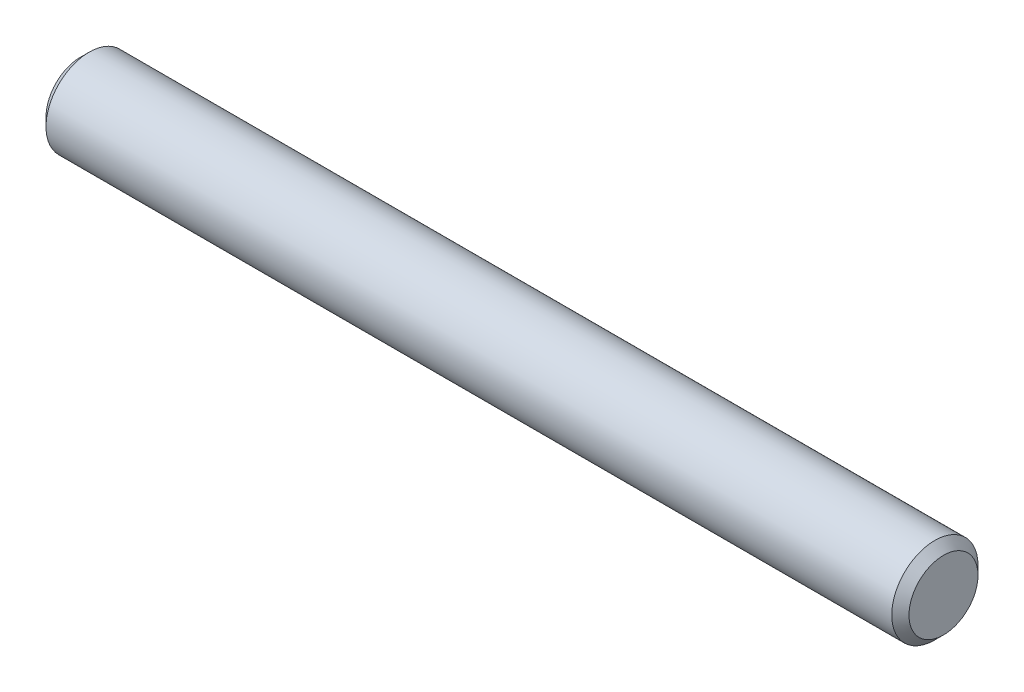
ISO-10303-21;
HEADER;
FILE_DESCRIPTION(('STEP AP214'),'2;1');
FILE_NAME('part.step','',(''),(''),'','','');
FILE_SCHEMA(('AUTOMOTIVE_DESIGN { 1 0 10303 214 1 1 1 1 }'));
ENDSEC;
DATA;
#1=APPLICATION_CONTEXT('core data for automotive mechanical design processes');
#2=APPLICATION_PROTOCOL_DEFINITION('international standard','automotive_design',2000,#1);
#3=PRODUCT_CONTEXT('',#1,'mechanical');
#4=PRODUCT('Part','Part','',(#3));
#5=PRODUCT_RELATED_PRODUCT_CATEGORY('part','',(#4));
#6=PRODUCT_DEFINITION_FORMATION('','',#4);
#7=PRODUCT_DEFINITION_CONTEXT('part definition',#1,'design');
#8=PRODUCT_DEFINITION('design','',#6,#7);
#9=PRODUCT_DEFINITION_SHAPE('','',#8);
#10=(LENGTH_UNIT() NAMED_UNIT(*) SI_UNIT(.MILLI.,.METRE.));
#11=(NAMED_UNIT(*) PLANE_ANGLE_UNIT() SI_UNIT($,.RADIAN.));
#12=(NAMED_UNIT(*) SI_UNIT($,.STERADIAN.) SOLID_ANGLE_UNIT());
#13=UNCERTAINTY_MEASURE_WITH_UNIT(LENGTH_MEASURE(1.E-05),#10,'distance_accuracy_value','');
#14=(GEOMETRIC_REPRESENTATION_CONTEXT(3) GLOBAL_UNCERTAINTY_ASSIGNED_CONTEXT((#13)) GLOBAL_UNIT_ASSIGNED_CONTEXT((#10,
#11,#12)) REPRESENTATION_CONTEXT('',''));
#15=CARTESIAN_POINT('',(0.,0.,0.));
#16=DIRECTION('',(0.,0.,1.));
#17=DIRECTION('',(1.,0.,0.));
#18=AXIS2_PLACEMENT_3D('',#15,#16,#17);
#19=CARTESIAN_POINT('',(-7.9375,0.,0.));
#20=DIRECTION('',(1.,0.,0.));
#21=DIRECTION('',(0.,0.,-1.));
#22=AXIS2_PLACEMENT_3D('',#19,#20,#21);
#23=CYLINDRICAL_SURFACE('',#22,0.79375);
#24=CARTESIAN_POINT('',(7.77874999999999,0.,0.));
#25=DIRECTION('',(1.,0.,0.));
#26=DIRECTION('',(0.,0.,-1.));
#27=AXIS2_PLACEMENT_3D('',#24,#25,#26);
#28=CIRCLE('',#27,0.79375);
#29=CARTESIAN_POINT('',(7.77874999999999,0.,-0.79375));
#30=VERTEX_POINT('',#29);
#31=EDGE_CURVE('E36',#30,#30,#28,.F.);
#32=ORIENTED_EDGE('',*,*,#31,.T.);
#33=EDGE_LOOP('',(#32));
#34=FACE_BOUND('',#33,.T.);
#35=CARTESIAN_POINT('',(-7.77875,0.,0.));
#36=DIRECTION('',(1.,0.,0.));
#37=DIRECTION('',(0.,0.,-1.));
#38=AXIS2_PLACEMENT_3D('',#35,#36,#37);
#39=CIRCLE('',#38,0.79375);
#40=CARTESIAN_POINT('',(-7.77875,0.,-0.79375));
#41=VERTEX_POINT('',#40);
#42=EDGE_CURVE('E40',#41,#41,#39,.T.);
#43=ORIENTED_EDGE('',*,*,#42,.T.);
#44=EDGE_LOOP('',(#43));
#45=FACE_BOUND('',#44,.T.);
#46=ADVANCED_FACE('F29',(#34,#45),#23,.T.);
#47=CARTESIAN_POINT('',(-7.9375,0.,0.));
#48=DIRECTION('',(1.,0.,0.));
#49=DIRECTION('',(0.,0.,-1.));
#50=AXIS2_PLACEMENT_3D('',#47,#48,#49);
#51=PLANE('',#50);
#52=CARTESIAN_POINT('',(-7.9375,0.,0.));
#53=DIRECTION('',(1.,0.,0.));
#54=DIRECTION('',(0.,0.,-1.));
#55=AXIS2_PLACEMENT_3D('',#52,#53,#54);
#56=CIRCLE('',#55,0.635);
#57=CARTESIAN_POINT('',(-7.9375,0.,-0.635));
#58=VERTEX_POINT('',#57);
#59=EDGE_CURVE('E10',#58,#58,#56,.F.);
#60=ORIENTED_EDGE('',*,*,#59,.T.);
#61=EDGE_LOOP('',(#60));
#62=FACE_BOUND('',#61,.T.);
#63=ADVANCED_FACE('F60',(#62),#51,.F.);
#64=CARTESIAN_POINT('',(7.9375,0.,0.));
#65=DIRECTION('',(1.,0.,0.));
#66=DIRECTION('',(0.,0.,-1.));
#67=AXIS2_PLACEMENT_3D('',#64,#65,#66);
#68=PLANE('',#67);
#69=CARTESIAN_POINT('',(7.9375,0.,0.));
#70=DIRECTION('',(1.,0.,0.));
#71=DIRECTION('',(0.,0.,-1.));
#72=AXIS2_PLACEMENT_3D('',#69,#70,#71);
#73=CIRCLE('',#72,0.635);
#74=CARTESIAN_POINT('',(7.9375,0.,-0.635));
#75=VERTEX_POINT('',#74);
#76=EDGE_CURVE('E44',#75,#75,#73,.T.);
#77=ORIENTED_EDGE('',*,*,#76,.T.);
#78=EDGE_LOOP('',(#77));
#79=FACE_BOUND('',#78,.T.);
#80=ADVANCED_FACE('F50',(#79),#68,.T.);
#81=CARTESIAN_POINT('',(7.9375,0.,0.));
#82=DIRECTION('',(-1.,0.,0.));
#83=DIRECTION('',(0.,0.,1.));
#84=AXIS2_PLACEMENT_3D('',#81,#82,#83);
#85=CONICAL_SURFACE('',#84,0.634999999999998,0.785398163397434);
#86=ORIENTED_EDGE('',*,*,#31,.F.);
#87=EDGE_LOOP('',(#86));
#88=FACE_BOUND('',#87,.T.);
#89=ORIENTED_EDGE('',*,*,#76,.F.);
#90=EDGE_LOOP('',(#89));
#91=FACE_BOUND('',#90,.T.);
#92=ADVANCED_FACE('F52',(#88,#91),#85,.T.);
#93=CARTESIAN_POINT('',(-7.77875,0.,0.));
#94=DIRECTION('',(1.,0.,0.));
#95=DIRECTION('',(0.,0.,-1.));
#96=AXIS2_PLACEMENT_3D('',#93,#94,#95);
#97=CONICAL_SURFACE('',#96,0.79375,0.78539816339745);
#98=ORIENTED_EDGE('',*,*,#59,.F.);
#99=EDGE_LOOP('',(#98));
#100=FACE_BOUND('',#99,.T.);
#101=ORIENTED_EDGE('',*,*,#42,.F.);
#102=EDGE_LOOP('',(#101));
#103=FACE_BOUND('',#102,.T.);
#104=ADVANCED_FACE('F31',(#100,#103),#97,.T.);
#105=CLOSED_SHELL('',(#46,#63,#80,#92,#104));
#106=MANIFOLD_SOLID_BREP('B2',#105);
#107=ADVANCED_BREP_SHAPE_REPRESENTATION('',(#18,#106),#14);
#108=SHAPE_DEFINITION_REPRESENTATION(#9,#107);
ENDSEC;
END-ISO-10303-21;
